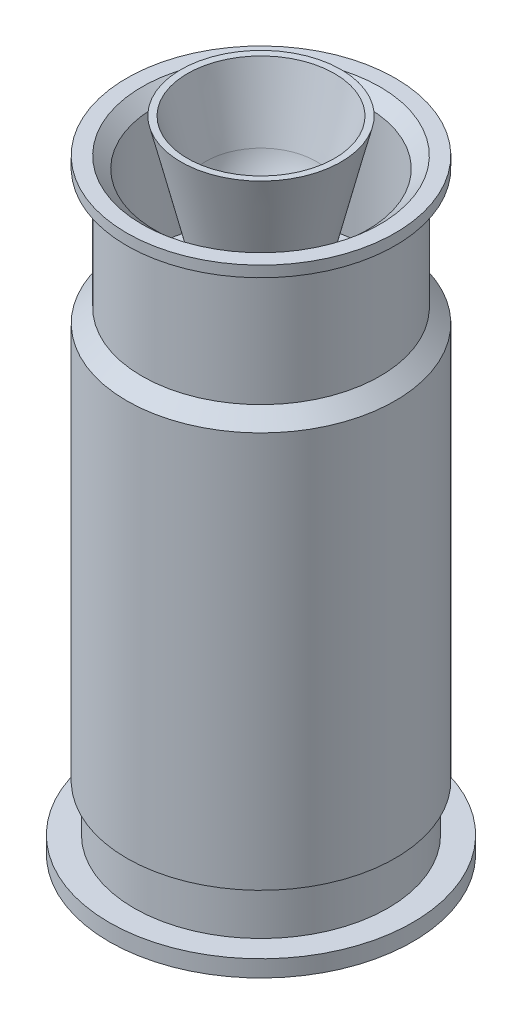
ISO-10303-21;
HEADER;
FILE_DESCRIPTION(('STEP AP214'),'2;1');
FILE_NAME('part.step','',(''),(''),'','','');
FILE_SCHEMA(('AUTOMOTIVE_DESIGN { 1 0 10303 214 1 1 1 1 }'));
ENDSEC;
DATA;
#1=APPLICATION_CONTEXT('core data for automotive mechanical design processes');
#2=APPLICATION_PROTOCOL_DEFINITION('international standard','automotive_design',2000,#1);
#3=PRODUCT_CONTEXT('',#1,'mechanical');
#4=PRODUCT('Part','Part','',(#3));
#5=PRODUCT_RELATED_PRODUCT_CATEGORY('part','',(#4));
#6=PRODUCT_DEFINITION_FORMATION('','',#4);
#7=PRODUCT_DEFINITION_CONTEXT('part definition',#1,'design');
#8=PRODUCT_DEFINITION('design','',#6,#7);
#9=PRODUCT_DEFINITION_SHAPE('','',#8);
#10=(LENGTH_UNIT() NAMED_UNIT(*) SI_UNIT(.MILLI.,.METRE.));
#11=(NAMED_UNIT(*) PLANE_ANGLE_UNIT() SI_UNIT($,.RADIAN.));
#12=(NAMED_UNIT(*) SI_UNIT($,.STERADIAN.) SOLID_ANGLE_UNIT());
#13=UNCERTAINTY_MEASURE_WITH_UNIT(LENGTH_MEASURE(1.E-05),#10,'distance_accuracy_value','');
#14=(GEOMETRIC_REPRESENTATION_CONTEXT(3) GLOBAL_UNCERTAINTY_ASSIGNED_CONTEXT((#13)) GLOBAL_UNIT_ASSIGNED_CONTEXT((#10,
#11,#12)) REPRESENTATION_CONTEXT('',''));
#15=CARTESIAN_POINT('',(0.,0.,0.));
#16=DIRECTION('',(0.,0.,1.));
#17=DIRECTION('',(1.,0.,0.));
#18=AXIS2_PLACEMENT_3D('',#15,#16,#17);
#19=CARTESIAN_POINT('',(0.,0.,0.));
#20=DIRECTION('',(0.,-1.,0.));
#21=DIRECTION('',(0.,0.,-1.));
#22=AXIS2_PLACEMENT_3D('',#19,#20,#21);
#23=CYLINDRICAL_SURFACE('',#22,8.4074);
#24=CARTESIAN_POINT('',(0.,10.2,0.));
#25=DIRECTION('',(0.,-1.,0.));
#26=DIRECTION('',(0.,0.,-1.));
#27=AXIS2_PLACEMENT_3D('',#24,#25,#26);
#28=CIRCLE('',#27,8.40740000000001);
#29=CARTESIAN_POINT('',(0.,10.2,-8.40740000000001));
#30=VERTEX_POINT('',#29);
#31=EDGE_CURVE('E11',#30,#30,#28,.T.);
#32=ORIENTED_EDGE('',*,*,#31,.T.);
#33=EDGE_LOOP('',(#32));
#34=FACE_BOUND('',#33,.T.);
#35=CARTESIAN_POINT('',(0.,281.827514285714,0.));
#36=DIRECTION('',(0.,-1.,0.));
#37=DIRECTION('',(0.,0.,-1.));
#38=AXIS2_PLACEMENT_3D('',#35,#36,#37);
#39=CIRCLE('',#38,8.4074);
#40=CARTESIAN_POINT('',(0.,281.827514285714,-8.4074));
#41=VERTEX_POINT('',#40);
#42=EDGE_CURVE('E57',#41,#41,#39,.T.);
#43=ORIENTED_EDGE('',*,*,#42,.F.);
#44=EDGE_LOOP('',(#43));
#45=FACE_BOUND('',#44,.T.);
#46=ADVANCED_FACE('F38',(#34,#45),#23,.F.);
#47=CARTESIAN_POINT('',(8.40740000000001,10.2,0.));
#48=DIRECTION('',(0.,-1.,0.));
#49=DIRECTION('',(0.,0.,-1.));
#50=AXIS2_PLACEMENT_3D('',#47,#48,#49);
#51=PLANE('',#50);
#52=CARTESIAN_POINT('',(0.,10.2,0.));
#53=DIRECTION('',(0.,-1.,0.));
#54=DIRECTION('',(0.,0.,-1.));
#55=AXIS2_PLACEMENT_3D('',#52,#53,#54);
#56=CIRCLE('',#55,67.0786991801437);
#57=CARTESIAN_POINT('',(0.,10.2,-67.0786991801437));
#58=VERTEX_POINT('',#57);
#59=EDGE_CURVE('E44',#58,#58,#56,.T.);
#60=ORIENTED_EDGE('',*,*,#59,.T.);
#61=EDGE_LOOP('',(#60));
#62=FACE_BOUND('',#61,.T.);
#63=ORIENTED_EDGE('',*,*,#31,.F.);
#64=EDGE_LOOP('',(#63));
#65=FACE_BOUND('',#64,.T.);
#66=ADVANCED_FACE('F65',(#62,#65),#51,.T.);
#67=CARTESIAN_POINT('',(0.,10.2,0.));
#68=DIRECTION('',(0.,1.,0.));
#69=DIRECTION('',(0.,0.,1.));
#70=AXIS2_PLACEMENT_3D('',#67,#68,#69);
#71=CONICAL_SURFACE('',#70,67.0786991801437,0.135011466001752);
#72=CARTESIAN_POINT('',(0.,53.975,0.));
#73=DIRECTION('',(0.,-1.,0.));
#74=DIRECTION('',(0.,0.,-1.));
#75=AXIS2_PLACEMENT_3D('',#72,#73,#74);
#76=CIRCLE('',#75,73.025);
#77=CARTESIAN_POINT('',(0.,53.975,-73.025));
#78=VERTEX_POINT('',#77);
#79=EDGE_CURVE('E48',#78,#78,#76,.T.);
#80=ORIENTED_EDGE('',*,*,#79,.T.);
#81=EDGE_LOOP('',(#80));
#82=FACE_BOUND('',#81,.T.);
#83=ORIENTED_EDGE('',*,*,#59,.F.);
#84=EDGE_LOOP('',(#83));
#85=FACE_BOUND('',#84,.T.);
#86=ADVANCED_FACE('F69',(#82,#85),#71,.T.);
#87=CARTESIAN_POINT('',(0.,0.,0.));
#88=DIRECTION('',(0.,-1.,0.));
#89=DIRECTION('',(0.,0.,-1.));
#90=AXIS2_PLACEMENT_3D('',#87,#88,#89);
#91=CYLINDRICAL_SURFACE('',#90,73.025);
#92=CARTESIAN_POINT('',(0.,273.05,0.));
#93=DIRECTION('',(0.,-1.,0.));
#94=DIRECTION('',(0.,0.,-1.));
#95=AXIS2_PLACEMENT_3D('',#92,#93,#94);
#96=CIRCLE('',#95,73.025);
#97=CARTESIAN_POINT('',(0.,273.05,-73.025));
#98=VERTEX_POINT('',#97);
#99=EDGE_CURVE('E52',#98,#98,#96,.T.);
#100=ORIENTED_EDGE('',*,*,#99,.T.);
#101=EDGE_LOOP('',(#100));
#102=FACE_BOUND('',#101,.T.);
#103=ORIENTED_EDGE('',*,*,#79,.F.);
#104=EDGE_LOOP('',(#103));
#105=FACE_BOUND('',#104,.T.);
#106=ADVANCED_FACE('F73',(#102,#105),#91,.T.);
#107=CARTESIAN_POINT('',(0.,273.05,0.));
#108=DIRECTION('',(0.,-1.,0.));
#109=DIRECTION('',(0.,0.,-1.));
#110=AXIS2_PLACEMENT_3D('',#107,#108,#109);
#111=CONICAL_SURFACE('',#110,73.025,1.43578486079315);
#112=ORIENTED_EDGE('',*,*,#42,.T.);
#113=EDGE_LOOP('',(#112));
#114=FACE_BOUND('',#113,.T.);
#115=ORIENTED_EDGE('',*,*,#99,.F.);
#116=EDGE_LOOP('',(#115));
#117=FACE_BOUND('',#116,.T.);
#118=ADVANCED_FACE('F61',(#114,#117),#111,.T.);
#119=CLOSED_SHELL('',(#46,#66,#86,#106,#118));
#120=MANIFOLD_SOLID_BREP('B2',#119);
#121=CARTESIAN_POINT('',(0.,0.,0.));
#122=DIRECTION('',(0.,-1.,0.));
#123=DIRECTION('',(0.,0.,-1.));
#124=AXIS2_PLACEMENT_3D('',#121,#122,#123);
#125=PLANE('',#124);
#126=CARTESIAN_POINT('',(0.,0.,0.));
#127=DIRECTION('',(0.,-1.,0.));
#128=DIRECTION('',(0.,0.,-1.));
#129=AXIS2_PLACEMENT_3D('',#126,#127,#128);
#130=CIRCLE('',#129,92.96);
#131=CARTESIAN_POINT('',(0.,0.,-92.96));
#132=VERTEX_POINT('',#131);
#133=EDGE_CURVE('E37',#132,#132,#130,.T.);
#134=ORIENTED_EDGE('',*,*,#133,.T.);
#135=EDGE_LOOP('',(#134));
#136=FACE_BOUND('',#135,.T.);
#137=ADVANCED_FACE('F114',(#136),#125,.T.);
#138=CARTESIAN_POINT('',(0.,0.,0.));
#139=DIRECTION('',(0.,-1.,0.));
#140=DIRECTION('',(0.,0.,-1.));
#141=AXIS2_PLACEMENT_3D('',#138,#139,#140);
#142=CYLINDRICAL_SURFACE('',#141,92.96);
#143=CARTESIAN_POINT('',(0.,10.2,0.));
#144=DIRECTION('',(0.,-1.,0.));
#145=DIRECTION('',(0.,0.,-1.));
#146=AXIS2_PLACEMENT_3D('',#143,#144,#145);
#147=CIRCLE('',#146,92.96);
#148=CARTESIAN_POINT('',(0.,10.2,-92.96));
#149=VERTEX_POINT('',#148);
#150=EDGE_CURVE('E120',#149,#149,#147,.T.);
#151=ORIENTED_EDGE('',*,*,#150,.T.);
#152=EDGE_LOOP('',(#151));
#153=FACE_BOUND('',#152,.T.);
#154=ORIENTED_EDGE('',*,*,#133,.F.);
#155=EDGE_LOOP('',(#154));
#156=FACE_BOUND('',#155,.T.);
#157=ADVANCED_FACE('F203',(#153,#156),#142,.T.);
#158=CARTESIAN_POINT('',(92.96,10.2,0.));
#159=DIRECTION('',(0.,1.,0.));
#160=DIRECTION('',(0.,0.,1.));
#161=AXIS2_PLACEMENT_3D('',#158,#159,#160);
#162=PLANE('',#161);
#163=CARTESIAN_POINT('',(0.,10.2,0.));
#164=DIRECTION('',(0.,-1.,0.));
#165=DIRECTION('',(0.,0.,-1.));
#166=AXIS2_PLACEMENT_3D('',#163,#164,#165);
#167=CIRCLE('',#166,77.766);
#168=CARTESIAN_POINT('',(0.,10.2,-77.766));
#169=VERTEX_POINT('',#168);
#170=EDGE_CURVE('E124',#169,#169,#167,.T.);
#171=ORIENTED_EDGE('',*,*,#170,.T.);
#172=EDGE_LOOP('',(#171));
#173=FACE_BOUND('',#172,.T.);
#174=ORIENTED_EDGE('',*,*,#150,.F.);
#175=EDGE_LOOP('',(#174));
#176=FACE_BOUND('',#175,.T.);
#177=ADVANCED_FACE('F207',(#173,#176),#162,.T.);
#178=CARTESIAN_POINT('',(0.,0.,0.));
#179=DIRECTION('',(0.,-1.,0.));
#180=DIRECTION('',(0.,0.,-1.));
#181=AXIS2_PLACEMENT_3D('',#178,#179,#180);
#182=CYLINDRICAL_SURFACE('',#181,77.766);
#183=CARTESIAN_POINT('',(0.,38.9,0.));
#184=DIRECTION('',(0.,-1.,0.));
#185=DIRECTION('',(0.,0.,-1.));
#186=AXIS2_PLACEMENT_3D('',#183,#184,#185);
#187=CIRCLE('',#186,77.766);
#188=CARTESIAN_POINT('',(0.,38.9,-77.766));
#189=VERTEX_POINT('',#188);
#190=EDGE_CURVE('E128',#189,#189,#187,.T.);
#191=ORIENTED_EDGE('',*,*,#190,.T.);
#192=EDGE_LOOP('',(#191));
#193=FACE_BOUND('',#192,.T.);
#194=ORIENTED_EDGE('',*,*,#170,.F.);
#195=EDGE_LOOP('',(#194));
#196=FACE_BOUND('',#195,.T.);
#197=ADVANCED_FACE('F211',(#193,#196),#182,.T.);
#198=CARTESIAN_POINT('',(77.766,38.9,0.));
#199=DIRECTION('',(0.,-1.,0.));
#200=DIRECTION('',(0.,0.,-1.));
#201=AXIS2_PLACEMENT_3D('',#198,#199,#200);
#202=PLANE('',#201);
#203=CARTESIAN_POINT('',(0.,38.9,0.));
#204=DIRECTION('',(0.,-1.,0.));
#205=DIRECTION('',(0.,0.,-1.));
#206=AXIS2_PLACEMENT_3D('',#203,#204,#205);
#207=CIRCLE('',#206,82.206);
#208=CARTESIAN_POINT('',(0.,38.9,-82.206));
#209=VERTEX_POINT('',#208);
#210=EDGE_CURVE('E133',#209,#209,#207,.T.);
#211=ORIENTED_EDGE('',*,*,#210,.T.);
#212=EDGE_LOOP('',(#211));
#213=FACE_BOUND('',#212,.T.);
#214=ORIENTED_EDGE('',*,*,#190,.F.);
#215=EDGE_LOOP('',(#214));
#216=FACE_BOUND('',#215,.T.);
#217=ADVANCED_FACE('F218',(#213,#216),#202,.T.);
#218=CARTESIAN_POINT('',(0.,0.,0.));
#219=DIRECTION('',(0.,-1.,0.));
#220=DIRECTION('',(0.,0.,-1.));
#221=AXIS2_PLACEMENT_3D('',#218,#219,#220);
#222=CYLINDRICAL_SURFACE('',#221,82.206);
#223=CARTESIAN_POINT('',(0.,281.51,0.));
#224=DIRECTION('',(0.,-1.,0.));
#225=DIRECTION('',(0.,0.,-1.));
#226=AXIS2_PLACEMENT_3D('',#223,#224,#225);
#227=CIRCLE('',#226,82.206);
#228=CARTESIAN_POINT('',(0.,281.51,-82.206));
#229=VERTEX_POINT('',#228);
#230=EDGE_CURVE('E136',#229,#229,#227,.T.);
#231=ORIENTED_EDGE('',*,*,#230,.T.);
#232=EDGE_LOOP('',(#231));
#233=FACE_BOUND('',#232,.T.);
#234=ORIENTED_EDGE('',*,*,#210,.F.);
#235=EDGE_LOOP('',(#234));
#236=FACE_BOUND('',#235,.T.);
#237=ADVANCED_FACE('F222',(#233,#236),#222,.T.);
#238=CARTESIAN_POINT('',(0.,281.51,0.));
#239=DIRECTION('',(0.,-1.,0.));
#240=DIRECTION('',(0.,0.,-1.));
#241=AXIS2_PLACEMENT_3D('',#238,#239,#240);
#242=CONICAL_SURFACE('',#241,82.206,0.835018797366868);
#243=CARTESIAN_POINT('',(0.,289.93,0.));
#244=DIRECTION('',(0.,-1.,0.));
#245=DIRECTION('',(0.,0.,-1.));
#246=AXIS2_PLACEMENT_3D('',#243,#244,#245);
#247=CIRCLE('',#246,72.906);
#248=CARTESIAN_POINT('',(0.,289.93,-72.906));
#249=VERTEX_POINT('',#248);
#250=EDGE_CURVE('E139',#249,#249,#247,.T.);
#251=ORIENTED_EDGE('',*,*,#250,.T.);
#252=EDGE_LOOP('',(#251));
#253=FACE_BOUND('',#252,.T.);
#254=ORIENTED_EDGE('',*,*,#230,.F.);
#255=EDGE_LOOP('',(#254));
#256=FACE_BOUND('',#255,.T.);
#257=ADVANCED_FACE('F226',(#253,#256),#242,.T.);
#258=CARTESIAN_POINT('',(0.,0.,0.));
#259=DIRECTION('',(0.,-1.,0.));
#260=DIRECTION('',(0.,0.,-1.));
#261=AXIS2_PLACEMENT_3D('',#258,#259,#260);
#262=CYLINDRICAL_SURFACE('',#261,72.906);
#263=CARTESIAN_POINT('',(0.,358.4,0.));
#264=DIRECTION('',(0.,-1.,0.));
#265=DIRECTION('',(0.,0.,-1.));
#266=AXIS2_PLACEMENT_3D('',#263,#264,#265);
#267=CIRCLE('',#266,72.906);
#268=CARTESIAN_POINT('',(0.,358.4,-72.906));
#269=VERTEX_POINT('',#268);
#270=EDGE_CURVE('E142',#269,#269,#267,.T.);
#271=ORIENTED_EDGE('',*,*,#270,.T.);
#272=EDGE_LOOP('',(#271));
#273=FACE_BOUND('',#272,.T.);
#274=ORIENTED_EDGE('',*,*,#250,.F.);
#275=EDGE_LOOP('',(#274));
#276=FACE_BOUND('',#275,.T.);
#277=ADVANCED_FACE('F230',(#273,#276),#262,.T.);
#278=CARTESIAN_POINT('',(0.,358.4,0.));
#279=DIRECTION('',(0.,1.,0.));
#280=DIRECTION('',(0.,0.,1.));
#281=AXIS2_PLACEMENT_3D('',#278,#279,#280);
#282=CONICAL_SURFACE('',#281,72.906,1.04472990779813);
#283=CARTESIAN_POINT('',(0.,363.8,0.));
#284=DIRECTION('',(0.,-1.,0.));
#285=DIRECTION('',(0.,0.,-1.));
#286=AXIS2_PLACEMENT_3D('',#283,#284,#285);
#287=CIRCLE('',#286,82.206);
#288=CARTESIAN_POINT('',(0.,363.8,-82.206));
#289=VERTEX_POINT('',#288);
#290=EDGE_CURVE('E145',#289,#289,#287,.T.);
#291=ORIENTED_EDGE('',*,*,#290,.T.);
#292=EDGE_LOOP('',(#291));
#293=FACE_BOUND('',#292,.T.);
#294=ORIENTED_EDGE('',*,*,#270,.F.);
#295=EDGE_LOOP('',(#294));
#296=FACE_BOUND('',#295,.T.);
#297=ADVANCED_FACE('F234',(#293,#296),#282,.T.);
#298=CARTESIAN_POINT('',(0.,0.,0.));
#299=DIRECTION('',(0.,-1.,0.));
#300=DIRECTION('',(0.,0.,-1.));
#301=AXIS2_PLACEMENT_3D('',#298,#299,#300);
#302=CYLINDRICAL_SURFACE('',#301,82.206);
#303=CARTESIAN_POINT('',(0.,370.5,0.));
#304=DIRECTION('',(0.,-1.,0.));
#305=DIRECTION('',(0.,0.,-1.));
#306=AXIS2_PLACEMENT_3D('',#303,#304,#305);
#307=CIRCLE('',#306,82.206);
#308=CARTESIAN_POINT('',(0.,370.5,-82.206));
#309=VERTEX_POINT('',#308);
#310=EDGE_CURVE('E148',#309,#309,#307,.T.);
#311=ORIENTED_EDGE('',*,*,#310,.T.);
#312=EDGE_LOOP('',(#311));
#313=FACE_BOUND('',#312,.T.);
#314=ORIENTED_EDGE('',*,*,#290,.F.);
#315=EDGE_LOOP('',(#314));
#316=FACE_BOUND('',#315,.T.);
#317=ADVANCED_FACE('F238',(#313,#316),#302,.T.);
#318=CARTESIAN_POINT('',(82.206,370.5,0.));
#319=DIRECTION('',(0.,1.,0.));
#320=DIRECTION('',(0.,0.,1.));
#321=AXIS2_PLACEMENT_3D('',#318,#319,#320);
#322=PLANE('',#321);
#323=CARTESIAN_POINT('',(0.,370.5,0.));
#324=DIRECTION('',(0.,-1.,0.));
#325=DIRECTION('',(0.,0.,-1.));
#326=AXIS2_PLACEMENT_3D('',#323,#324,#325);
#327=CIRCLE('',#326,72.906);
#328=CARTESIAN_POINT('',(0.,370.5,-72.906));
#329=VERTEX_POINT('',#328);
#330=EDGE_CURVE('E151',#329,#329,#327,.T.);
#331=ORIENTED_EDGE('',*,*,#330,.T.);
#332=EDGE_LOOP('',(#331));
#333=FACE_BOUND('',#332,.T.);
#334=ORIENTED_EDGE('',*,*,#310,.F.);
#335=EDGE_LOOP('',(#334));
#336=FACE_BOUND('',#335,.T.);
#337=ADVANCED_FACE('F242',(#333,#336),#322,.T.);
#338=CARTESIAN_POINT('',(0.,370.5,0.));
#339=DIRECTION('',(0.,1.,0.));
#340=DIRECTION('',(0.,0.,1.));
#341=AXIS2_PLACEMENT_3D('',#338,#339,#340);
#342=CONICAL_SURFACE('',#341,72.906,0.843245735558769);
#343=CARTESIAN_POINT('',(0.,363.5375,0.));
#344=DIRECTION('',(0.,-1.,0.));
#345=DIRECTION('',(0.,0.,-1.));
#346=AXIS2_PLACEMENT_3D('',#343,#344,#345);
#347=CIRCLE('',#346,65.0875);
#348=CARTESIAN_POINT('',(0.,363.5375,-65.0875));
#349=VERTEX_POINT('',#348);
#350=EDGE_CURVE('E154',#349,#349,#347,.T.);
#351=ORIENTED_EDGE('',*,*,#350,.T.);
#352=EDGE_LOOP('',(#351));
#353=FACE_BOUND('',#352,.T.);
#354=ORIENTED_EDGE('',*,*,#330,.F.);
#355=EDGE_LOOP('',(#354));
#356=FACE_BOUND('',#355,.T.);
#357=ADVANCED_FACE('F246',(#353,#356),#342,.F.);
#358=CARTESIAN_POINT('',(0.,0.,0.));
#359=DIRECTION('',(0.,-1.,0.));
#360=DIRECTION('',(0.,0.,-1.));
#361=AXIS2_PLACEMENT_3D('',#358,#359,#360);
#362=CYLINDRICAL_SURFACE('',#361,65.0875);
#363=CARTESIAN_POINT('',(0.,289.93,0.));
#364=DIRECTION('',(0.,-1.,0.));
#365=DIRECTION('',(0.,0.,-1.));
#366=AXIS2_PLACEMENT_3D('',#363,#364,#365);
#367=CIRCLE('',#366,65.0875);
#368=CARTESIAN_POINT('',(0.,289.93,-65.0875));
#369=VERTEX_POINT('',#368);
#370=EDGE_CURVE('E157',#369,#369,#367,.T.);
#371=ORIENTED_EDGE('',*,*,#370,.T.);
#372=EDGE_LOOP('',(#371));
#373=FACE_BOUND('',#372,.T.);
#374=ORIENTED_EDGE('',*,*,#350,.F.);
#375=EDGE_LOOP('',(#374));
#376=FACE_BOUND('',#375,.T.);
#377=ADVANCED_FACE('F250',(#373,#376),#362,.F.);
#378=CARTESIAN_POINT('',(65.0875,289.93,0.));
#379=DIRECTION('',(0.,1.,0.));
#380=DIRECTION('',(0.,0.,1.));
#381=AXIS2_PLACEMENT_3D('',#378,#379,#380);
#382=PLANE('',#381);
#383=CARTESIAN_POINT('',(0.,289.93,0.));
#384=DIRECTION('',(0.,-1.,0.));
#385=DIRECTION('',(0.,0.,-1.));
#386=AXIS2_PLACEMENT_3D('',#383,#384,#385);
#387=CIRCLE('',#386,24.2981904194634);
#388=CARTESIAN_POINT('',(0.,289.93,-24.2981904194634));
#389=VERTEX_POINT('',#388);
#390=EDGE_CURVE('E160',#389,#389,#387,.T.);
#391=ORIENTED_EDGE('',*,*,#390,.T.);
#392=EDGE_LOOP('',(#391));
#393=FACE_BOUND('',#392,.T.);
#394=ORIENTED_EDGE('',*,*,#370,.F.);
#395=EDGE_LOOP('',(#394));
#396=FACE_BOUND('',#395,.T.);
#397=ADVANCED_FACE('F254',(#393,#396),#382,.T.);
#398=CARTESIAN_POINT('',(0.,289.93,0.));
#399=DIRECTION('',(0.,1.,0.));
#400=DIRECTION('',(0.,0.,1.));
#401=AXIS2_PLACEMENT_3D('',#398,#399,#400);
#402=CONICAL_SURFACE('',#401,24.2981904194634,0.238708695824109);
#403=CARTESIAN_POINT('',(0.,391.62287958398,0.));
#404=DIRECTION('',(0.,-1.,0.));
#405=DIRECTION('',(0.,0.,-1.));
#406=AXIS2_PLACEMENT_3D('',#403,#404,#405);
#407=CIRCLE('',#406,49.045);
#408=CARTESIAN_POINT('',(0.,391.62287958398,-49.045));
#409=VERTEX_POINT('',#408);
#410=EDGE_CURVE('E163',#409,#409,#407,.T.);
#411=ORIENTED_EDGE('',*,*,#410,.T.);
#412=EDGE_LOOP('',(#411));
#413=FACE_BOUND('',#412,.T.);
#414=ORIENTED_EDGE('',*,*,#390,.F.);
#415=EDGE_LOOP('',(#414));
#416=FACE_BOUND('',#415,.T.);
#417=ADVANCED_FACE('F258',(#413,#416),#402,.T.);
#418=CARTESIAN_POINT('',(0.,391.62287958398,0.));
#419=DIRECTION('',(0.,1.,0.));
#420=DIRECTION('',(0.,0.,1.));
#421=AXIS2_PLACEMENT_3D('',#418,#419,#420);
#422=CONICAL_SURFACE('',#421,49.045,1.54008608891008);
#423=CARTESIAN_POINT('',(0.,391.5,0.));
#424=DIRECTION('',(0.,-1.,0.));
#425=DIRECTION('',(0.,0.,-1.));
#426=AXIS2_PLACEMENT_3D('',#423,#424,#425);
#427=CIRCLE('',#426,45.045);
#428=CARTESIAN_POINT('',(0.,391.5,-45.045));
#429=VERTEX_POINT('',#428);
#430=EDGE_CURVE('E166',#429,#429,#427,.T.);
#431=ORIENTED_EDGE('',*,*,#430,.T.);
#432=EDGE_LOOP('',(#431));
#433=FACE_BOUND('',#432,.T.);
#434=ORIENTED_EDGE('',*,*,#410,.F.);
#435=EDGE_LOOP('',(#434));
#436=FACE_BOUND('',#435,.T.);
#437=ADVANCED_FACE('F262',(#433,#436),#422,.F.);
#438=CARTESIAN_POINT('',(0.,391.5,0.));
#439=DIRECTION('',(0.,1.,0.));
#440=DIRECTION('',(0.,0.,1.));
#441=AXIS2_PLACEMENT_3D('',#438,#439,#440);
#442=CONICAL_SURFACE('',#441,45.045,0.268507454864229);
#443=CARTESIAN_POINT('',(0.,350.560926443321,0.));
#444=DIRECTION('',(0.,-1.,0.));
#445=DIRECTION('',(0.,0.,-1.));
#446=AXIS2_PLACEMENT_3D('',#443,#444,#445);
#447=CIRCLE('',#446,33.7805348397197);
#448=CARTESIAN_POINT('',(0.,350.560926443321,-33.7805348397197));
#449=VERTEX_POINT('',#448);
#450=EDGE_CURVE('E169',#449,#449,#447,.T.);
#451=ORIENTED_EDGE('',*,*,#450,.T.);
#452=EDGE_LOOP('',(#451));
#453=FACE_BOUND('',#452,.T.);
#454=ORIENTED_EDGE('',*,*,#430,.F.);
#455=EDGE_LOOP('',(#454));
#456=FACE_BOUND('',#455,.T.);
#457=ADVANCED_FACE('F266',(#453,#456),#442,.F.);
#458=CARTESIAN_POINT('',(0.,362.383333233923,0.));
#459=DIRECTION('',(0.,-1.,0.));
#460=DIRECTION('',(0.,0.,-1.));
#461=AXIS2_PLACEMENT_3D('',#458,#459,#460);
#462=DEGENERATE_TOROIDAL_SURFACE('',#461,14.8016707264907,50.,.F.);
#463=CARTESIAN_POINT('',(0.,324.081111077974,0.));
#464=DIRECTION('',(0.,-1.,0.));
#465=DIRECTION('',(0.,0.,-1.));
#466=AXIS2_PLACEMENT_3D('',#463,#464,#465);
#467=CIRCLE('',#466,17.3377097578364);
#468=CARTESIAN_POINT('',(0.,324.081111077974,-17.3377097578364));
#469=VERTEX_POINT('',#468);
#470=EDGE_CURVE('E172',#469,#469,#467,.T.);
#471=ORIENTED_EDGE('',*,*,#470,.T.);
#472=EDGE_LOOP('',(#471));
#473=FACE_BOUND('',#472,.T.);
#474=ORIENTED_EDGE('',*,*,#450,.F.);
#475=EDGE_LOOP('',(#474));
#476=FACE_BOUND('',#475,.T.);
#477=ADVANCED_FACE('F270',(#473,#476),#462,.T.);
#478=CARTESIAN_POINT('',(0.,304.93,0.));
#479=DIRECTION('',(0.,-1.,0.));
#480=DIRECTION('',(0.,0.,-1.));
#481=AXIS2_PLACEMENT_3D('',#478,#479,#480);
#482=TOROIDAL_SURFACE('',#481,33.4074,25.);
#483=CARTESIAN_POINT('',(0.,280.025132547706,0.));
#484=DIRECTION('',(0.,-1.,0.));
#485=DIRECTION('',(0.,0.,-1.));
#486=AXIS2_PLACEMENT_3D('',#483,#484,#485);
#487=CIRCLE('',#486,35.5862935686914);
#488=CARTESIAN_POINT('',(0.,280.025132547706,-35.5862935686914));
#489=VERTEX_POINT('',#488);
#490=EDGE_CURVE('E175',#489,#489,#487,.T.);
#491=ORIENTED_EDGE('',*,*,#490,.T.);
#492=EDGE_LOOP('',(#491));
#493=FACE_BOUND('',#492,.T.);
#494=ORIENTED_EDGE('',*,*,#470,.F.);
#495=EDGE_LOOP('',(#494));
#496=FACE_BOUND('',#495,.T.);
#497=ADVANCED_FACE('F274',(#493,#496),#482,.T.);
#498=CARTESIAN_POINT('',(0.,280.025132547706,0.));
#499=DIRECTION('',(0.,-1.,0.));
#500=DIRECTION('',(0.,0.,-1.));
#501=AXIS2_PLACEMENT_3D('',#498,#499,#500);
#502=CONICAL_SURFACE('',#501,35.5862935686914,1.45974703447171);
#503=CARTESIAN_POINT('',(0.,275.321756157594,0.));
#504=DIRECTION('',(0.,-1.,0.));
#505=DIRECTION('',(0.,0.,-1.));
#506=AXIS2_PLACEMENT_3D('',#503,#504,#505);
#507=CIRCLE('',#506,77.766);
#508=CARTESIAN_POINT('',(0.,275.321756157594,-77.766));
#509=VERTEX_POINT('',#508);
#510=EDGE_CURVE('E178',#509,#509,#507,.T.);
#511=ORIENTED_EDGE('',*,*,#510,.T.);
#512=EDGE_LOOP('',(#511));
#513=FACE_BOUND('',#512,.T.);
#514=ORIENTED_EDGE('',*,*,#490,.F.);
#515=EDGE_LOOP('',(#514));
#516=FACE_BOUND('',#515,.T.);
#517=ADVANCED_FACE('F278',(#513,#516),#502,.F.);
#518=CARTESIAN_POINT('',(0.,0.,0.));
#519=DIRECTION('',(0.,-1.,0.));
#520=DIRECTION('',(0.,0.,-1.));
#521=AXIS2_PLACEMENT_3D('',#518,#519,#520);
#522=CYLINDRICAL_SURFACE('',#521,77.766);
#523=CARTESIAN_POINT('',(0.,47.2311364004631,0.));
#524=DIRECTION('',(0.,-1.,0.));
#525=DIRECTION('',(0.,0.,-1.));
#526=AXIS2_PLACEMENT_3D('',#523,#524,#525);
#527=CIRCLE('',#526,77.766);
#528=CARTESIAN_POINT('',(0.,47.2311364004631,-77.766));
#529=VERTEX_POINT('',#528);
#530=EDGE_CURVE('E181',#529,#529,#527,.T.);
#531=ORIENTED_EDGE('',*,*,#530,.T.);
#532=EDGE_LOOP('',(#531));
#533=FACE_BOUND('',#532,.T.);
#534=ORIENTED_EDGE('',*,*,#510,.F.);
#535=EDGE_LOOP('',(#534));
#536=FACE_BOUND('',#535,.T.);
#537=ADVANCED_FACE('F282',(#533,#536),#522,.F.);
#538=CARTESIAN_POINT('',(0.,47.2311364004631,0.));
#539=DIRECTION('',(0.,1.,0.));
#540=DIRECTION('',(0.,0.,1.));
#541=AXIS2_PLACEMENT_3D('',#538,#539,#540);
#542=CONICAL_SURFACE('',#541,77.766,0.785398163397434);
#543=CARTESIAN_POINT('',(0.,43.2311364004629,0.));
#544=DIRECTION('',(0.,-1.,0.));
#545=DIRECTION('',(0.,0.,-1.));
#546=AXIS2_PLACEMENT_3D('',#543,#544,#545);
#547=CIRCLE('',#546,73.766);
#548=CARTESIAN_POINT('',(0.,43.2311364004629,-73.766));
#549=VERTEX_POINT('',#548);
#550=EDGE_CURVE('E184',#549,#549,#547,.T.);
#551=ORIENTED_EDGE('',*,*,#550,.T.);
#552=EDGE_LOOP('',(#551));
#553=FACE_BOUND('',#552,.T.);
#554=ORIENTED_EDGE('',*,*,#530,.F.);
#555=EDGE_LOOP('',(#554));
#556=FACE_BOUND('',#555,.T.);
#557=ADVANCED_FACE('F200',(#553,#556),#542,.F.);
#558=CARTESIAN_POINT('',(0.,0.,0.));
#559=DIRECTION('',(0.,-1.,0.));
#560=DIRECTION('',(0.,0.,-1.));
#561=AXIS2_PLACEMENT_3D('',#558,#559,#560);
#562=CYLINDRICAL_SURFACE('',#561,73.766);
#563=CARTESIAN_POINT('',(0.,4.,0.));
#564=DIRECTION('',(0.,-1.,0.));
#565=DIRECTION('',(0.,0.,-1.));
#566=AXIS2_PLACEMENT_3D('',#563,#564,#565);
#567=CIRCLE('',#566,73.766);
#568=CARTESIAN_POINT('',(0.,4.,-73.766));
#569=VERTEX_POINT('',#568);
#570=EDGE_CURVE('E187',#569,#569,#567,.T.);
#571=ORIENTED_EDGE('',*,*,#570,.T.);
#572=EDGE_LOOP('',(#571));
#573=FACE_BOUND('',#572,.T.);
#574=ORIENTED_EDGE('',*,*,#550,.F.);
#575=EDGE_LOOP('',(#574));
#576=FACE_BOUND('',#575,.T.);
#577=ADVANCED_FACE('F191',(#573,#576),#562,.F.);
#578=CARTESIAN_POINT('',(0.,4.,0.));
#579=DIRECTION('',(0.,1.,0.));
#580=DIRECTION('',(0.,0.,1.));
#581=AXIS2_PLACEMENT_3D('',#578,#579,#580);
#582=PLANE('',#581);
#583=ORIENTED_EDGE('',*,*,#570,.F.);
#584=EDGE_LOOP('',(#583));
#585=FACE_BOUND('',#584,.T.);
#586=ADVANCED_FACE('F194',(#585),#582,.T.);
#587=CLOSED_SHELL('',(#137,#157,#177,#197,#217,#237,#257,#277,#297,#317,#337,#357,#377,#397,
#417,#437,#457,#477,#497,#517,#537,#557,#577,#586));
#588=MANIFOLD_SOLID_BREP('B6',#587);
#589=ADVANCED_BREP_SHAPE_REPRESENTATION('',(#18,#120,#588),#14);
#590=SHAPE_DEFINITION_REPRESENTATION(#9,#589);
ENDSEC;
END-ISO-10303-21;
